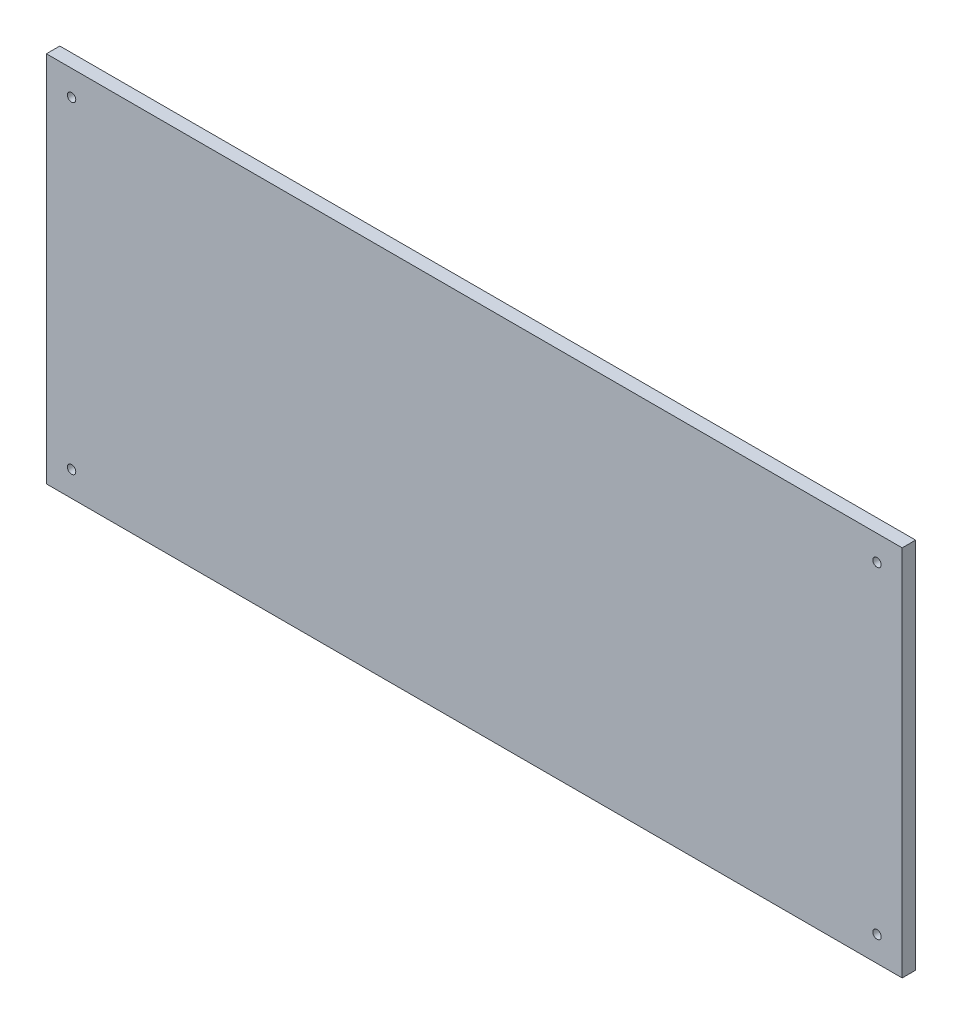
ISO-10303-21;
HEADER;
FILE_DESCRIPTION(('STEP AP214'),'2;1');
FILE_NAME('part.step','',(''),(''),'','','');
FILE_SCHEMA(('AUTOMOTIVE_DESIGN { 1 0 10303 214 1 1 1 1 }'));
ENDSEC;
DATA;
#1=APPLICATION_CONTEXT('core data for automotive mechanical design processes');
#2=APPLICATION_PROTOCOL_DEFINITION('international standard','automotive_design',2000,#1);
#3=PRODUCT_CONTEXT('',#1,'mechanical');
#4=PRODUCT('Part','Part','',(#3));
#5=PRODUCT_RELATED_PRODUCT_CATEGORY('part','',(#4));
#6=PRODUCT_DEFINITION_FORMATION('','',#4);
#7=PRODUCT_DEFINITION_CONTEXT('part definition',#1,'design');
#8=PRODUCT_DEFINITION('design','',#6,#7);
#9=PRODUCT_DEFINITION_SHAPE('','',#8);
#10=(LENGTH_UNIT() NAMED_UNIT(*) SI_UNIT(.MILLI.,.METRE.));
#11=(NAMED_UNIT(*) PLANE_ANGLE_UNIT() SI_UNIT($,.RADIAN.));
#12=(NAMED_UNIT(*) SI_UNIT($,.STERADIAN.) SOLID_ANGLE_UNIT());
#13=UNCERTAINTY_MEASURE_WITH_UNIT(LENGTH_MEASURE(1.E-05),#10,'distance_accuracy_value','');
#14=(GEOMETRIC_REPRESENTATION_CONTEXT(3) GLOBAL_UNCERTAINTY_ASSIGNED_CONTEXT((#13)) GLOBAL_UNIT_ASSIGNED_CONTEXT((#10,
#11,#12)) REPRESENTATION_CONTEXT('',''));
#15=CARTESIAN_POINT('',(0.,0.,0.));
#16=DIRECTION('',(0.,0.,1.));
#17=DIRECTION('',(1.,0.,0.));
#18=AXIS2_PLACEMENT_3D('',#15,#16,#17);
#19=CARTESIAN_POINT('',(161.925,-152.4,-243.205));
#20=DIRECTION('',(1.,0.,0.));
#21=DIRECTION('',(0.,0.,-1.));
#22=AXIS2_PLACEMENT_3D('',#19,#20,#21);
#23=PLANE('',#22);
#24=DIRECTION('',(0.,1.,0.));
#25=VECTOR('',#24,1.);
#26=CARTESIAN_POINT('',(161.925,-152.4,-238.125));
#27=LINE('',#26,#25);
#28=CARTESIAN_POINT('',(161.925,-152.4,-238.125));
#29=VERTEX_POINT('',#28);
#30=CARTESIAN_POINT('',(161.925,-11.4299999999999,-238.125));
#31=VERTEX_POINT('',#30);
#32=EDGE_CURVE('E98',#29,#31,#27,.T.);
#33=ORIENTED_EDGE('',*,*,#32,.F.);
#34=DIRECTION('',(0.,0.,1.));
#35=VECTOR('',#34,1.);
#36=CARTESIAN_POINT('',(161.925,-152.4,-243.205));
#37=LINE('',#36,#35);
#38=CARTESIAN_POINT('',(161.925,-152.4,-243.205));
#39=VERTEX_POINT('',#38);
#40=EDGE_CURVE('E11',#39,#29,#37,.T.);
#41=ORIENTED_EDGE('',*,*,#40,.F.);
#42=DIRECTION('',(0.,1.,0.));
#43=VECTOR('',#42,1.);
#44=CARTESIAN_POINT('',(161.925,-152.4,-243.205));
#45=LINE('',#44,#43);
#46=CARTESIAN_POINT('',(161.925,-11.4299999999999,-243.205));
#47=VERTEX_POINT('',#46);
#48=EDGE_CURVE('E91',#39,#47,#45,.T.);
#49=ORIENTED_EDGE('',*,*,#48,.T.);
#50=DIRECTION('',(0.,0.,1.));
#51=VECTOR('',#50,1.);
#52=CARTESIAN_POINT('',(161.925,-11.4299999999999,-243.205));
#53=LINE('',#52,#51);
#54=EDGE_CURVE('E36',#47,#31,#53,.T.);
#55=ORIENTED_EDGE('',*,*,#54,.T.);
#56=EDGE_LOOP('',(#33,#41,#49,#55));
#57=FACE_BOUND('',#56,.T.);
#58=ADVANCED_FACE('F33',(#57),#23,.T.);
#59=CARTESIAN_POINT('',(-161.925,-152.4,-243.205));
#60=DIRECTION('',(0.,-1.,0.));
#61=DIRECTION('',(0.,0.,-1.));
#62=AXIS2_PLACEMENT_3D('',#59,#60,#61);
#63=PLANE('',#62);
#64=DIRECTION('',(1.,0.,0.));
#65=VECTOR('',#64,1.);
#66=CARTESIAN_POINT('',(-161.925,-152.4,-238.125));
#67=LINE('',#66,#65);
#68=CARTESIAN_POINT('',(-161.925,-152.4,-238.125));
#69=VERTEX_POINT('',#68);
#70=EDGE_CURVE('E93',#69,#29,#67,.T.);
#71=ORIENTED_EDGE('',*,*,#70,.F.);
#72=DIRECTION('',(0.,0.,1.));
#73=VECTOR('',#72,1.);
#74=CARTESIAN_POINT('',(-161.925,-152.4,-243.205));
#75=LINE('',#74,#73);
#76=CARTESIAN_POINT('',(-161.925,-152.4,-243.205));
#77=VERTEX_POINT('',#76);
#78=EDGE_CURVE('E42',#77,#69,#75,.T.);
#79=ORIENTED_EDGE('',*,*,#78,.F.);
#80=DIRECTION('',(1.,0.,0.));
#81=VECTOR('',#80,1.);
#82=CARTESIAN_POINT('',(-161.925,-152.4,-243.205));
#83=LINE('',#82,#81);
#84=EDGE_CURVE('E88',#77,#39,#83,.T.);
#85=ORIENTED_EDGE('',*,*,#84,.T.);
#86=ORIENTED_EDGE('',*,*,#40,.T.);
#87=EDGE_LOOP('',(#71,#79,#85,#86));
#88=FACE_BOUND('',#87,.T.);
#89=ADVANCED_FACE('F109',(#88),#63,.T.);
#90=CARTESIAN_POINT('',(-161.925,-152.4,-243.205));
#91=DIRECTION('',(-1.,0.,0.));
#92=DIRECTION('',(0.,0.,1.));
#93=AXIS2_PLACEMENT_3D('',#90,#91,#92);
#94=PLANE('',#93);
#95=DIRECTION('',(0.,-1.,0.));
#96=VECTOR('',#95,1.);
#97=CARTESIAN_POINT('',(-161.925,-152.4,-238.125));
#98=LINE('',#97,#96);
#99=CARTESIAN_POINT('',(-161.925,-11.4299999999999,-238.125));
#100=VERTEX_POINT('',#99);
#101=EDGE_CURVE('E83',#100,#69,#98,.T.);
#102=ORIENTED_EDGE('',*,*,#101,.F.);
#103=DIRECTION('',(0.,0.,1.));
#104=VECTOR('',#103,1.);
#105=CARTESIAN_POINT('',(-161.925,-11.4299999999999,-243.205));
#106=LINE('',#105,#104);
#107=CARTESIAN_POINT('',(-161.925,-11.4299999999999,-243.205));
#108=VERTEX_POINT('',#107);
#109=EDGE_CURVE('E78',#108,#100,#106,.T.);
#110=ORIENTED_EDGE('',*,*,#109,.F.);
#111=DIRECTION('',(0.,-1.,0.));
#112=VECTOR('',#111,1.);
#113=CARTESIAN_POINT('',(-161.925,-152.4,-243.205));
#114=LINE('',#113,#112);
#115=EDGE_CURVE('E81',#108,#77,#114,.T.);
#116=ORIENTED_EDGE('',*,*,#115,.T.);
#117=ORIENTED_EDGE('',*,*,#78,.T.);
#118=EDGE_LOOP('',(#102,#110,#116,#117));
#119=FACE_BOUND('',#118,.T.);
#120=ADVANCED_FACE('F80',(#119),#94,.T.);
#121=CARTESIAN_POINT('',(-161.925,-11.4299999999999,-243.205));
#122=DIRECTION('',(0.,1.,0.));
#123=DIRECTION('',(0.,0.,1.));
#124=AXIS2_PLACEMENT_3D('',#121,#122,#123);
#125=PLANE('',#124);
#126=DIRECTION('',(-1.,0.,0.));
#127=VECTOR('',#126,1.);
#128=CARTESIAN_POINT('',(-161.925,-11.4299999999999,-238.125));
#129=LINE('',#128,#127);
#130=EDGE_CURVE('E101',#31,#100,#129,.T.);
#131=ORIENTED_EDGE('',*,*,#130,.F.);
#132=ORIENTED_EDGE('',*,*,#54,.F.);
#133=DIRECTION('',(-1.,0.,0.));
#134=VECTOR('',#133,1.);
#135=CARTESIAN_POINT('',(-161.925,-11.4299999999999,-243.205));
#136=LINE('',#135,#134);
#137=EDGE_CURVE('E87',#47,#108,#136,.T.);
#138=ORIENTED_EDGE('',*,*,#137,.T.);
#139=ORIENTED_EDGE('',*,*,#109,.T.);
#140=EDGE_LOOP('',(#131,#132,#138,#139));
#141=FACE_BOUND('',#140,.T.);
#142=ADVANCED_FACE('F90',(#141),#125,.T.);
#143=CARTESIAN_POINT('',(0.,0.,-243.205));
#144=DIRECTION('',(0.,0.,-1.));
#145=DIRECTION('',(-1.,0.,0.));
#146=AXIS2_PLACEMENT_3D('',#143,#144,#145);
#147=PLANE('',#146);
#148=CARTESIAN_POINT('',(-152.399999999998,-142.875,-243.205));
#149=DIRECTION('',(0.,0.,1.));
#150=DIRECTION('',(1.,0.,0.));
#151=AXIS2_PLACEMENT_3D('',#148,#149,#150);
#152=CIRCLE('',#151,1.58749999999999);
#153=CARTESIAN_POINT('',(-150.812499999998,-142.875,-243.205));
#154=VERTEX_POINT('',#153);
#155=EDGE_CURVE('E150',#154,#154,#152,.T.);
#156=ORIENTED_EDGE('',*,*,#155,.T.);
#157=EDGE_LOOP('',(#156));
#158=FACE_BOUND('',#157,.T.);
#159=CARTESIAN_POINT('',(152.4,-142.875,-243.205));
#160=DIRECTION('',(0.,0.,1.));
#161=DIRECTION('',(1.,0.,0.));
#162=AXIS2_PLACEMENT_3D('',#159,#160,#161);
#163=CIRCLE('',#162,1.58750000000288);
#164=CARTESIAN_POINT('',(153.987500000003,-142.875,-243.205));
#165=VERTEX_POINT('',#164);
#166=EDGE_CURVE('E158',#165,#165,#163,.T.);
#167=ORIENTED_EDGE('',*,*,#166,.T.);
#168=EDGE_LOOP('',(#167));
#169=FACE_BOUND('',#168,.T.);
#170=CARTESIAN_POINT('',(152.4,-20.9549999999999,-243.205));
#171=DIRECTION('',(0.,0.,1.));
#172=DIRECTION('',(1.,0.,0.));
#173=AXIS2_PLACEMENT_3D('',#170,#171,#172);
#174=CIRCLE('',#173,1.58750000000123);
#175=CARTESIAN_POINT('',(153.987500000001,-20.9549999999999,-243.205));
#176=VERTEX_POINT('',#175);
#177=EDGE_CURVE('E164',#176,#176,#174,.T.);
#178=ORIENTED_EDGE('',*,*,#177,.T.);
#179=EDGE_LOOP('',(#178));
#180=FACE_BOUND('',#179,.T.);
#181=CARTESIAN_POINT('',(-152.4,-20.9549999999999,-243.205));
#182=DIRECTION('',(0.,0.,1.));
#183=DIRECTION('',(1.,0.,0.));
#184=AXIS2_PLACEMENT_3D('',#181,#182,#183);
#185=CIRCLE('',#184,1.58749999999999);
#186=CARTESIAN_POINT('',(-150.8125,-20.9549999999999,-243.205));
#187=VERTEX_POINT('',#186);
#188=EDGE_CURVE('E102',#187,#187,#185,.T.);
#189=ORIENTED_EDGE('',*,*,#188,.T.);
#190=EDGE_LOOP('',(#189));
#191=FACE_BOUND('',#190,.T.);
#192=ORIENTED_EDGE('',*,*,#48,.F.);
#193=ORIENTED_EDGE('',*,*,#84,.F.);
#194=ORIENTED_EDGE('',*,*,#115,.F.);
#195=ORIENTED_EDGE('',*,*,#137,.F.);
#196=EDGE_LOOP('',(#192,#193,#194,#195));
#197=FACE_BOUND('',#196,.T.);
#198=ADVANCED_FACE('F86',(#158,#169,#180,#191,#197),#147,.T.);
#199=CARTESIAN_POINT('',(0.,0.,-238.125));
#200=DIRECTION('',(0.,0.,-1.));
#201=DIRECTION('',(-1.,0.,0.));
#202=AXIS2_PLACEMENT_3D('',#199,#200,#201);
#203=PLANE('',#202);
#204=CARTESIAN_POINT('',(-152.399999999998,-142.875,-238.125));
#205=DIRECTION('',(0.,0.,1.));
#206=DIRECTION('',(1.,0.,0.));
#207=AXIS2_PLACEMENT_3D('',#204,#205,#206);
#208=CIRCLE('',#207,1.58749999999999);
#209=CARTESIAN_POINT('',(-150.812499999998,-142.875,-238.125));
#210=VERTEX_POINT('',#209);
#211=EDGE_CURVE('E153',#210,#210,#208,.T.);
#212=ORIENTED_EDGE('',*,*,#211,.F.);
#213=EDGE_LOOP('',(#212));
#214=FACE_BOUND('',#213,.T.);
#215=CARTESIAN_POINT('',(152.4,-142.875,-238.125));
#216=DIRECTION('',(0.,0.,1.));
#217=DIRECTION('',(1.,0.,0.));
#218=AXIS2_PLACEMENT_3D('',#215,#216,#217);
#219=CIRCLE('',#218,1.58750000000288);
#220=CARTESIAN_POINT('',(153.987500000003,-142.875,-238.125));
#221=VERTEX_POINT('',#220);
#222=EDGE_CURVE('E155',#221,#221,#219,.T.);
#223=ORIENTED_EDGE('',*,*,#222,.F.);
#224=EDGE_LOOP('',(#223));
#225=FACE_BOUND('',#224,.T.);
#226=CARTESIAN_POINT('',(152.4,-20.9549999999999,-238.125));
#227=DIRECTION('',(0.,0.,1.));
#228=DIRECTION('',(1.,0.,0.));
#229=AXIS2_PLACEMENT_3D('',#226,#227,#228);
#230=CIRCLE('',#229,1.58750000000123);
#231=CARTESIAN_POINT('',(153.987500000001,-20.9549999999999,-238.125));
#232=VERTEX_POINT('',#231);
#233=EDGE_CURVE('E161',#232,#232,#230,.T.);
#234=ORIENTED_EDGE('',*,*,#233,.F.);
#235=EDGE_LOOP('',(#234));
#236=FACE_BOUND('',#235,.T.);
#237=CARTESIAN_POINT('',(-152.4,-20.9549999999999,-238.125));
#238=DIRECTION('',(0.,0.,1.));
#239=DIRECTION('',(1.,0.,0.));
#240=AXIS2_PLACEMENT_3D('',#237,#238,#239);
#241=CIRCLE('',#240,1.58749999999999);
#242=CARTESIAN_POINT('',(-150.8125,-20.9549999999999,-238.125));
#243=VERTEX_POINT('',#242);
#244=EDGE_CURVE('E167',#243,#243,#241,.T.);
#245=ORIENTED_EDGE('',*,*,#244,.F.);
#246=EDGE_LOOP('',(#245));
#247=FACE_BOUND('',#246,.T.);
#248=ORIENTED_EDGE('',*,*,#32,.T.);
#249=ORIENTED_EDGE('',*,*,#130,.T.);
#250=ORIENTED_EDGE('',*,*,#101,.T.);
#251=ORIENTED_EDGE('',*,*,#70,.T.);
#252=EDGE_LOOP('',(#248,#249,#250,#251));
#253=FACE_BOUND('',#252,.T.);
#254=ADVANCED_FACE('F108',(#214,#225,#236,#247,#253),#203,.F.);
#255=CARTESIAN_POINT('',(-152.4,-20.9549999999999,-243.205));
#256=DIRECTION('',(0.,0.,1.));
#257=DIRECTION('',(1.,0.,0.));
#258=AXIS2_PLACEMENT_3D('',#255,#256,#257);
#259=CYLINDRICAL_SURFACE('',#258,1.58749999999999);
#260=ORIENTED_EDGE('',*,*,#188,.F.);
#261=EDGE_LOOP('',(#260));
#262=FACE_BOUND('',#261,.T.);
#263=ORIENTED_EDGE('',*,*,#244,.T.);
#264=EDGE_LOOP('',(#263));
#265=FACE_BOUND('',#264,.T.);
#266=ADVANCED_FACE('F127',(#262,#265),#259,.F.);
#267=CARTESIAN_POINT('',(152.4,-20.9549999999999,-243.205));
#268=DIRECTION('',(0.,0.,1.));
#269=DIRECTION('',(1.,0.,0.));
#270=AXIS2_PLACEMENT_3D('',#267,#268,#269);
#271=CYLINDRICAL_SURFACE('',#270,1.58750000000123);
#272=ORIENTED_EDGE('',*,*,#177,.F.);
#273=EDGE_LOOP('',(#272));
#274=FACE_BOUND('',#273,.T.);
#275=ORIENTED_EDGE('',*,*,#233,.T.);
#276=EDGE_LOOP('',(#275));
#277=FACE_BOUND('',#276,.T.);
#278=ADVANCED_FACE('F134',(#274,#277),#271,.F.);
#279=CARTESIAN_POINT('',(152.4,-142.875,-243.205));
#280=DIRECTION('',(0.,0.,1.));
#281=DIRECTION('',(1.,0.,0.));
#282=AXIS2_PLACEMENT_3D('',#279,#280,#281);
#283=CYLINDRICAL_SURFACE('',#282,1.58750000000288);
#284=ORIENTED_EDGE('',*,*,#166,.F.);
#285=EDGE_LOOP('',(#284));
#286=FACE_BOUND('',#285,.T.);
#287=ORIENTED_EDGE('',*,*,#222,.T.);
#288=EDGE_LOOP('',(#287));
#289=FACE_BOUND('',#288,.T.);
#290=ADVANCED_FACE('F138',(#286,#289),#283,.F.);
#291=CARTESIAN_POINT('',(-152.399999999998,-142.875,-243.205));
#292=DIRECTION('',(0.,0.,1.));
#293=DIRECTION('',(1.,0.,0.));
#294=AXIS2_PLACEMENT_3D('',#291,#292,#293);
#295=CYLINDRICAL_SURFACE('',#294,1.58749999999999);
#296=ORIENTED_EDGE('',*,*,#155,.F.);
#297=EDGE_LOOP('',(#296));
#298=FACE_BOUND('',#297,.T.);
#299=ORIENTED_EDGE('',*,*,#211,.T.);
#300=EDGE_LOOP('',(#299));
#301=FACE_BOUND('',#300,.T.);
#302=ADVANCED_FACE('F142',(#298,#301),#295,.F.);
#303=CLOSED_SHELL('',(#58,#89,#120,#142,#198,#254,#266,#278,#290,#302));
#304=MANIFOLD_SOLID_BREP('B2',#303);
#305=ADVANCED_BREP_SHAPE_REPRESENTATION('',(#18,#304),#14);
#306=SHAPE_DEFINITION_REPRESENTATION(#9,#305);
ENDSEC;
END-ISO-10303-21;
